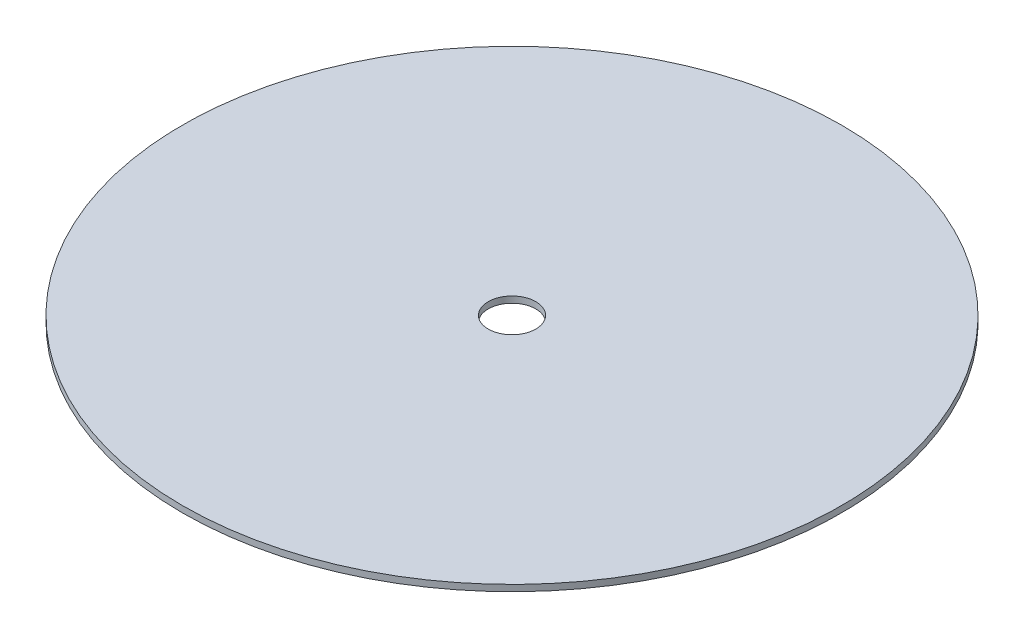
ISO-10303-21;
HEADER;
FILE_DESCRIPTION(('STEP AP214'),'2;1');
FILE_NAME('part.step','',(''),(''),'','','');
FILE_SCHEMA(('AUTOMOTIVE_DESIGN { 1 0 10303 214 1 1 1 1 }'));
ENDSEC;
DATA;
#1=APPLICATION_CONTEXT('core data for automotive mechanical design processes');
#2=APPLICATION_PROTOCOL_DEFINITION('international standard','automotive_design',2000,#1);
#3=PRODUCT_CONTEXT('',#1,'mechanical');
#4=PRODUCT('Part','Part','',(#3));
#5=PRODUCT_RELATED_PRODUCT_CATEGORY('part','',(#4));
#6=PRODUCT_DEFINITION_FORMATION('','',#4);
#7=PRODUCT_DEFINITION_CONTEXT('part definition',#1,'design');
#8=PRODUCT_DEFINITION('design','',#6,#7);
#9=PRODUCT_DEFINITION_SHAPE('','',#8);
#10=(LENGTH_UNIT() NAMED_UNIT(*) SI_UNIT(.MILLI.,.METRE.));
#11=(NAMED_UNIT(*) PLANE_ANGLE_UNIT() SI_UNIT($,.RADIAN.));
#12=(NAMED_UNIT(*) SI_UNIT($,.STERADIAN.) SOLID_ANGLE_UNIT());
#13=UNCERTAINTY_MEASURE_WITH_UNIT(LENGTH_MEASURE(1.E-05),#10,'distance_accuracy_value','');
#14=(GEOMETRIC_REPRESENTATION_CONTEXT(3) GLOBAL_UNCERTAINTY_ASSIGNED_CONTEXT((#13)) GLOBAL_UNIT_ASSIGNED_CONTEXT((#10,
#11,#12)) REPRESENTATION_CONTEXT('',''));
#15=CARTESIAN_POINT('',(0.,0.,0.));
#16=DIRECTION('',(0.,0.,1.));
#17=DIRECTION('',(1.,0.,0.));
#18=AXIS2_PLACEMENT_3D('',#15,#16,#17);
#19=CARTESIAN_POINT('',(0.,1.27,0.));
#20=DIRECTION('',(0.,1.,0.));
#21=DIRECTION('',(0.,0.,1.));
#22=AXIS2_PLACEMENT_3D('',#19,#20,#21);
#23=PLANE('',#22);
#24=CARTESIAN_POINT('',(0.,1.27,0.));
#25=DIRECTION('',(0.,1.,0.));
#26=DIRECTION('',(0.,0.,1.));
#27=AXIS2_PLACEMENT_3D('',#24,#25,#26);
#28=CIRCLE('',#27,66.04);
#29=CARTESIAN_POINT('',(0.,1.27,66.04));
#30=VERTEX_POINT('',#29);
#31=EDGE_CURVE('E10',#30,#30,#28,.T.);
#32=ORIENTED_EDGE('',*,*,#31,.T.);
#33=EDGE_LOOP('',(#32));
#34=FACE_BOUND('',#33,.T.);
#35=CARTESIAN_POINT('',(0.,1.27,0.));
#36=DIRECTION('',(0.,1.,0.));
#37=DIRECTION('',(0.,0.,1.));
#38=AXIS2_PLACEMENT_3D('',#35,#36,#37);
#39=CIRCLE('',#38,4.7625);
#40=CARTESIAN_POINT('',(0.,1.27,4.7625));
#41=VERTEX_POINT('',#40);
#42=EDGE_CURVE('E42',#41,#41,#39,.T.);
#43=ORIENTED_EDGE('',*,*,#42,.F.);
#44=EDGE_LOOP('',(#43));
#45=FACE_BOUND('',#44,.T.);
#46=ADVANCED_FACE('F31',(#34,#45),#23,.T.);
#47=CARTESIAN_POINT('',(0.,0.,0.));
#48=DIRECTION('',(0.,1.,0.));
#49=DIRECTION('',(0.,0.,1.));
#50=AXIS2_PLACEMENT_3D('',#47,#48,#49);
#51=PLANE('',#50);
#52=CARTESIAN_POINT('',(0.,0.,0.));
#53=DIRECTION('',(0.,1.,0.));
#54=DIRECTION('',(0.,0.,1.));
#55=AXIS2_PLACEMENT_3D('',#52,#53,#54);
#56=CIRCLE('',#55,66.04);
#57=CARTESIAN_POINT('',(0.,0.,66.04));
#58=VERTEX_POINT('',#57);
#59=EDGE_CURVE('E35',#58,#58,#56,.T.);
#60=ORIENTED_EDGE('',*,*,#59,.F.);
#61=EDGE_LOOP('',(#60));
#62=FACE_BOUND('',#61,.T.);
#63=CARTESIAN_POINT('',(0.,0.,0.));
#64=DIRECTION('',(0.,1.,0.));
#65=DIRECTION('',(0.,0.,1.));
#66=AXIS2_PLACEMENT_3D('',#63,#64,#65);
#67=CIRCLE('',#66,4.7625);
#68=CARTESIAN_POINT('',(0.,0.,4.7625));
#69=VERTEX_POINT('',#68);
#70=EDGE_CURVE('E44',#69,#69,#67,.T.);
#71=ORIENTED_EDGE('',*,*,#70,.T.);
#72=EDGE_LOOP('',(#71));
#73=FACE_BOUND('',#72,.T.);
#74=ADVANCED_FACE('F54',(#62,#73),#51,.F.);
#75=CARTESIAN_POINT('',(0.,1.27,0.));
#76=DIRECTION('',(0.,-1.,0.));
#77=DIRECTION('',(0.,0.,-1.));
#78=AXIS2_PLACEMENT_3D('',#75,#76,#77);
#79=CYLINDRICAL_SURFACE('',#78,66.04);
#80=ORIENTED_EDGE('',*,*,#31,.F.);
#81=EDGE_LOOP('',(#80));
#82=FACE_BOUND('',#81,.T.);
#83=ORIENTED_EDGE('',*,*,#59,.T.);
#84=EDGE_LOOP('',(#83));
#85=FACE_BOUND('',#84,.T.);
#86=ADVANCED_FACE('F33',(#82,#85),#79,.T.);
#87=CARTESIAN_POINT('',(0.,1.27,0.));
#88=DIRECTION('',(0.,-1.,0.));
#89=DIRECTION('',(0.,0.,-1.));
#90=AXIS2_PLACEMENT_3D('',#87,#88,#89);
#91=CYLINDRICAL_SURFACE('',#90,4.7625);
#92=ORIENTED_EDGE('',*,*,#42,.T.);
#93=EDGE_LOOP('',(#92));
#94=FACE_BOUND('',#93,.T.);
#95=ORIENTED_EDGE('',*,*,#70,.F.);
#96=EDGE_LOOP('',(#95));
#97=FACE_BOUND('',#96,.T.);
#98=ADVANCED_FACE('F50',(#94,#97),#91,.F.);
#99=CLOSED_SHELL('',(#46,#74,#86,#98));
#100=MANIFOLD_SOLID_BREP('B2',#99);
#101=ADVANCED_BREP_SHAPE_REPRESENTATION('',(#18,#100),#14);
#102=SHAPE_DEFINITION_REPRESENTATION(#9,#101);
ENDSEC;
END-ISO-10303-21;
